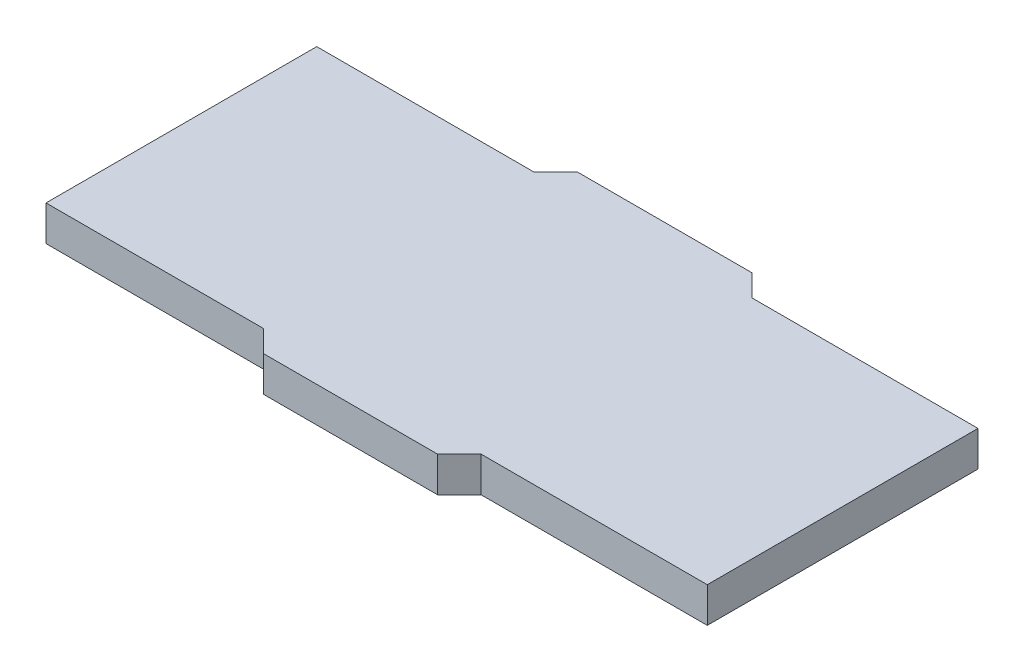
ISO-10303-21;
HEADER;
FILE_DESCRIPTION(('STEP AP214'),'2;1');
FILE_NAME('part.step','',(''),(''),'','','');
FILE_SCHEMA(('AUTOMOTIVE_DESIGN { 1 0 10303 214 1 1 1 1 }'));
ENDSEC;
DATA;
#1=APPLICATION_CONTEXT('core data for automotive mechanical design processes');
#2=APPLICATION_PROTOCOL_DEFINITION('international standard','automotive_design',2000,#1);
#3=PRODUCT_CONTEXT('',#1,'mechanical');
#4=PRODUCT('Part','Part','',(#3));
#5=PRODUCT_RELATED_PRODUCT_CATEGORY('part','',(#4));
#6=PRODUCT_DEFINITION_FORMATION('','',#4);
#7=PRODUCT_DEFINITION_CONTEXT('part definition',#1,'design');
#8=PRODUCT_DEFINITION('design','',#6,#7);
#9=PRODUCT_DEFINITION_SHAPE('','',#8);
#10=(LENGTH_UNIT() NAMED_UNIT(*) SI_UNIT(.MILLI.,.METRE.));
#11=(NAMED_UNIT(*) PLANE_ANGLE_UNIT() SI_UNIT($,.RADIAN.));
#12=(NAMED_UNIT(*) SI_UNIT($,.STERADIAN.) SOLID_ANGLE_UNIT());
#13=UNCERTAINTY_MEASURE_WITH_UNIT(LENGTH_MEASURE(1.E-05),#10,'distance_accuracy_value','');
#14=(GEOMETRIC_REPRESENTATION_CONTEXT(3) GLOBAL_UNCERTAINTY_ASSIGNED_CONTEXT((#13)) GLOBAL_UNIT_ASSIGNED_CONTEXT((#10,
#11,#12)) REPRESENTATION_CONTEXT('',''));
#15=CARTESIAN_POINT('',(0.,0.,0.));
#16=DIRECTION('',(0.,0.,1.));
#17=DIRECTION('',(1.,0.,0.));
#18=AXIS2_PLACEMENT_3D('',#15,#16,#17);
#19=CARTESIAN_POINT('',(10.,1.62,-6.223));
#20=DIRECTION('',(-0.707106781186548,0.,-0.707106781186548));
#21=DIRECTION('',(-0.707106781186548,0.,0.707106781186548));
#22=AXIS2_PLACEMENT_3D('',#19,#20,#21);
#23=PLANE('',#22);
#24=DIRECTION('',(0.707106781186548,0.,-0.707106781186548));
#25=VECTOR('',#24,1.);
#26=CARTESIAN_POINT('',(10.,0.,-6.223));
#27=LINE('',#26,#25);
#28=CARTESIAN_POINT('',(10.,0.,-6.223));
#29=VERTEX_POINT('',#28);
#30=CARTESIAN_POINT('',(11.,0.,-7.223));
#31=VERTEX_POINT('',#30);
#32=EDGE_CURVE('E154',#29,#31,#27,.T.);
#33=ORIENTED_EDGE('',*,*,#32,.F.);
#34=DIRECTION('',(0.,-1.,0.));
#35=VECTOR('',#34,1.);
#36=CARTESIAN_POINT('',(10.,1.62,-6.223));
#37=LINE('',#36,#35);
#38=CARTESIAN_POINT('',(10.,1.62,-6.223));
#39=VERTEX_POINT('',#38);
#40=EDGE_CURVE('E11',#39,#29,#37,.T.);
#41=ORIENTED_EDGE('',*,*,#40,.F.);
#42=DIRECTION('',(0.707106781186548,0.,-0.707106781186548));
#43=VECTOR('',#42,1.);
#44=CARTESIAN_POINT('',(10.,1.62,-6.223));
#45=LINE('',#44,#43);
#46=CARTESIAN_POINT('',(11.,1.62,-7.223));
#47=VERTEX_POINT('',#46);
#48=EDGE_CURVE('E179',#39,#47,#45,.T.);
#49=ORIENTED_EDGE('',*,*,#48,.T.);
#50=DIRECTION('',(0.,-1.,0.));
#51=VECTOR('',#50,1.);
#52=CARTESIAN_POINT('',(11.,1.62,-7.223));
#53=LINE('',#52,#51);
#54=EDGE_CURVE('E35',#47,#31,#53,.T.);
#55=ORIENTED_EDGE('',*,*,#54,.T.);
#56=EDGE_LOOP('',(#33,#41,#49,#55));
#57=FACE_BOUND('',#56,.T.);
#58=ADVANCED_FACE('F32',(#57),#23,.T.);
#59=CARTESIAN_POINT('',(10.,1.62,-6.223));
#60=DIRECTION('',(0.,0.,1.));
#61=DIRECTION('',(1.,0.,0.));
#62=AXIS2_PLACEMENT_3D('',#59,#60,#61);
#63=PLANE('',#62);
#64=DIRECTION('',(-1.,0.,0.));
#65=VECTOR('',#64,1.);
#66=CARTESIAN_POINT('',(10.,0.,-6.223));
#67=LINE('',#66,#65);
#68=CARTESIAN_POINT('',(0.,0.,-6.223));
#69=VERTEX_POINT('',#68);
#70=EDGE_CURVE('E89',#29,#69,#67,.T.);
#71=ORIENTED_EDGE('',*,*,#70,.T.);
#72=DIRECTION('',(0.,-1.,0.));
#73=VECTOR('',#72,1.);
#74=CARTESIAN_POINT('',(0.,1.62,-6.223));
#75=LINE('',#74,#73);
#76=CARTESIAN_POINT('',(0.,1.62,-6.223));
#77=VERTEX_POINT('',#76);
#78=EDGE_CURVE('E41',#77,#69,#75,.T.);
#79=ORIENTED_EDGE('',*,*,#78,.F.);
#80=DIRECTION('',(-1.,0.,0.));
#81=VECTOR('',#80,1.);
#82=CARTESIAN_POINT('',(10.,1.62,-6.223));
#83=LINE('',#82,#81);
#84=EDGE_CURVE('E132',#39,#77,#83,.T.);
#85=ORIENTED_EDGE('',*,*,#84,.F.);
#86=ORIENTED_EDGE('',*,*,#40,.T.);
#87=EDGE_LOOP('',(#71,#79,#85,#86));
#88=FACE_BOUND('',#87,.T.);
#89=ADVANCED_FACE('F259',(#88),#63,.F.);
#90=CARTESIAN_POINT('',(0.,1.62,-6.223));
#91=DIRECTION('',(1.,0.,0.));
#92=DIRECTION('',(0.,0.,-1.));
#93=AXIS2_PLACEMENT_3D('',#90,#91,#92);
#94=PLANE('',#93);
#95=DIRECTION('',(0.,0.,1.));
#96=VECTOR('',#95,1.);
#97=CARTESIAN_POINT('',(0.,0.,-6.223));
#98=LINE('',#97,#96);
#99=CARTESIAN_POINT('',(0.,0.,6.223));
#100=VERTEX_POINT('',#99);
#101=EDGE_CURVE('E139',#69,#100,#98,.T.);
#102=ORIENTED_EDGE('',*,*,#101,.T.);
#103=DIRECTION('',(0.,-1.,0.));
#104=VECTOR('',#103,1.);
#105=CARTESIAN_POINT('',(0.,1.62,6.223));
#106=LINE('',#105,#104);
#107=CARTESIAN_POINT('',(0.,1.62,6.223));
#108=VERTEX_POINT('',#107);
#109=EDGE_CURVE('E136',#108,#100,#106,.T.);
#110=ORIENTED_EDGE('',*,*,#109,.F.);
#111=DIRECTION('',(0.,0.,1.));
#112=VECTOR('',#111,1.);
#113=CARTESIAN_POINT('',(0.,1.62,-6.223));
#114=LINE('',#113,#112);
#115=EDGE_CURVE('E125',#77,#108,#114,.T.);
#116=ORIENTED_EDGE('',*,*,#115,.F.);
#117=ORIENTED_EDGE('',*,*,#78,.T.);
#118=EDGE_LOOP('',(#102,#110,#116,#117));
#119=FACE_BOUND('',#118,.T.);
#120=ADVANCED_FACE('F137',(#119),#94,.F.);
#121=CARTESIAN_POINT('',(0.,1.62,6.223));
#122=DIRECTION('',(0.,0.,-1.));
#123=DIRECTION('',(-1.,0.,0.));
#124=AXIS2_PLACEMENT_3D('',#121,#122,#123);
#125=PLANE('',#124);
#126=DIRECTION('',(1.,0.,0.));
#127=VECTOR('',#126,1.);
#128=CARTESIAN_POINT('',(0.,0.,6.223));
#129=LINE('',#128,#127);
#130=CARTESIAN_POINT('',(10.,0.,6.223));
#131=VERTEX_POINT('',#130);
#132=EDGE_CURVE('E176',#100,#131,#129,.T.);
#133=ORIENTED_EDGE('',*,*,#132,.T.);
#134=DIRECTION('',(0.,-1.,0.));
#135=VECTOR('',#134,1.);
#136=CARTESIAN_POINT('',(10.,1.62,6.223));
#137=LINE('',#136,#135);
#138=CARTESIAN_POINT('',(10.,1.62,6.223));
#139=VERTEX_POINT('',#138);
#140=EDGE_CURVE('E142',#139,#131,#137,.T.);
#141=ORIENTED_EDGE('',*,*,#140,.F.);
#142=DIRECTION('',(1.,0.,0.));
#143=VECTOR('',#142,1.);
#144=CARTESIAN_POINT('',(0.,1.62,6.223));
#145=LINE('',#144,#143);
#146=EDGE_CURVE('E130',#108,#139,#145,.T.);
#147=ORIENTED_EDGE('',*,*,#146,.F.);
#148=ORIENTED_EDGE('',*,*,#109,.T.);
#149=EDGE_LOOP('',(#133,#141,#147,#148));
#150=FACE_BOUND('',#149,.T.);
#151=ADVANCED_FACE('F144',(#150),#125,.F.);
#152=CARTESIAN_POINT('',(10.,1.62,6.223));
#153=DIRECTION('',(0.707106781186548,0.,-0.707106781186548));
#154=DIRECTION('',(-0.707106781186548,0.,-0.707106781186548));
#155=AXIS2_PLACEMENT_3D('',#152,#153,#154);
#156=PLANE('',#155);
#157=DIRECTION('',(0.707106781186548,0.,0.707106781186548));
#158=VECTOR('',#157,1.);
#159=CARTESIAN_POINT('',(10.,0.,6.223));
#160=LINE('',#159,#158);
#161=CARTESIAN_POINT('',(11.,0.,7.223));
#162=VERTEX_POINT('',#161);
#163=EDGE_CURVE('E174',#131,#162,#160,.T.);
#164=ORIENTED_EDGE('',*,*,#163,.T.);
#165=DIRECTION('',(0.,-1.,0.));
#166=VECTOR('',#165,1.);
#167=CARTESIAN_POINT('',(11.,1.62,7.223));
#168=LINE('',#167,#166);
#169=CARTESIAN_POINT('',(11.,1.62,7.223));
#170=VERTEX_POINT('',#169);
#171=EDGE_CURVE('E183',#170,#162,#168,.T.);
#172=ORIENTED_EDGE('',*,*,#171,.F.);
#173=DIRECTION('',(0.707106781186548,0.,0.707106781186548));
#174=VECTOR('',#173,1.);
#175=CARTESIAN_POINT('',(10.,1.62,6.223));
#176=LINE('',#175,#174);
#177=EDGE_CURVE('E147',#139,#170,#176,.T.);
#178=ORIENTED_EDGE('',*,*,#177,.F.);
#179=ORIENTED_EDGE('',*,*,#140,.T.);
#180=EDGE_LOOP('',(#164,#172,#178,#179));
#181=FACE_BOUND('',#180,.T.);
#182=ADVANCED_FACE('F207',(#181),#156,.F.);
#183=CARTESIAN_POINT('',(11.,1.62,7.223));
#184=DIRECTION('',(0.,0.,-1.));
#185=DIRECTION('',(-1.,0.,0.));
#186=AXIS2_PLACEMENT_3D('',#183,#184,#185);
#187=PLANE('',#186);
#188=DIRECTION('',(1.,0.,0.));
#189=VECTOR('',#188,1.);
#190=CARTESIAN_POINT('',(11.,0.,7.223));
#191=LINE('',#190,#189);
#192=CARTESIAN_POINT('',(19.,0.,7.223));
#193=VERTEX_POINT('',#192);
#194=EDGE_CURVE('E172',#162,#193,#191,.T.);
#195=ORIENTED_EDGE('',*,*,#194,.T.);
#196=DIRECTION('',(0.,-1.,0.));
#197=VECTOR('',#196,1.);
#198=CARTESIAN_POINT('',(19.,1.62,7.223));
#199=LINE('',#198,#197);
#200=CARTESIAN_POINT('',(19.,1.62,7.223));
#201=VERTEX_POINT('',#200);
#202=EDGE_CURVE('E186',#201,#193,#199,.T.);
#203=ORIENTED_EDGE('',*,*,#202,.F.);
#204=DIRECTION('',(1.,0.,0.));
#205=VECTOR('',#204,1.);
#206=CARTESIAN_POINT('',(11.,1.62,7.223));
#207=LINE('',#206,#205);
#208=EDGE_CURVE('E149',#170,#201,#207,.T.);
#209=ORIENTED_EDGE('',*,*,#208,.F.);
#210=ORIENTED_EDGE('',*,*,#171,.T.);
#211=EDGE_LOOP('',(#195,#203,#209,#210));
#212=FACE_BOUND('',#211,.T.);
#213=ADVANCED_FACE('F215',(#212),#187,.F.);
#214=CARTESIAN_POINT('',(19.,1.62,7.223));
#215=DIRECTION('',(-0.707106781186548,0.,-0.707106781186547));
#216=DIRECTION('',(-0.707106781186547,0.,0.707106781186548));
#217=AXIS2_PLACEMENT_3D('',#214,#215,#216);
#218=PLANE('',#217);
#219=DIRECTION('',(0.707106781186547,0.,-0.707106781186548));
#220=VECTOR('',#219,1.);
#221=CARTESIAN_POINT('',(19.,0.,7.223));
#222=LINE('',#221,#220);
#223=CARTESIAN_POINT('',(20.,0.,6.223));
#224=VERTEX_POINT('',#223);
#225=EDGE_CURVE('E170',#193,#224,#222,.T.);
#226=ORIENTED_EDGE('',*,*,#225,.T.);
#227=DIRECTION('',(0.,-1.,0.));
#228=VECTOR('',#227,1.);
#229=CARTESIAN_POINT('',(20.,1.62,6.223));
#230=LINE('',#229,#228);
#231=CARTESIAN_POINT('',(20.,1.62,6.223));
#232=VERTEX_POINT('',#231);
#233=EDGE_CURVE('E189',#232,#224,#230,.T.);
#234=ORIENTED_EDGE('',*,*,#233,.F.);
#235=DIRECTION('',(0.707106781186547,0.,-0.707106781186548));
#236=VECTOR('',#235,1.);
#237=CARTESIAN_POINT('',(19.,1.62,7.223));
#238=LINE('',#237,#236);
#239=EDGE_CURVE('E212',#201,#232,#238,.T.);
#240=ORIENTED_EDGE('',*,*,#239,.F.);
#241=ORIENTED_EDGE('',*,*,#202,.T.);
#242=EDGE_LOOP('',(#226,#234,#240,#241));
#243=FACE_BOUND('',#242,.T.);
#244=ADVANCED_FACE('F218',(#243),#218,.F.);
#245=CARTESIAN_POINT('',(20.,1.62,6.223));
#246=DIRECTION('',(0.,0.,-1.));
#247=DIRECTION('',(-1.,0.,0.));
#248=AXIS2_PLACEMENT_3D('',#245,#246,#247);
#249=PLANE('',#248);
#250=DIRECTION('',(1.,0.,0.));
#251=VECTOR('',#250,1.);
#252=CARTESIAN_POINT('',(20.,0.,6.223));
#253=LINE('',#252,#251);
#254=CARTESIAN_POINT('',(30.4,0.,6.223));
#255=VERTEX_POINT('',#254);
#256=EDGE_CURVE('E168',#224,#255,#253,.T.);
#257=ORIENTED_EDGE('',*,*,#256,.T.);
#258=DIRECTION('',(0.,-1.,0.));
#259=VECTOR('',#258,1.);
#260=CARTESIAN_POINT('',(30.4,1.62,6.223));
#261=LINE('',#260,#259);
#262=CARTESIAN_POINT('',(30.4,1.62,6.223));
#263=VERTEX_POINT('',#262);
#264=EDGE_CURVE('E192',#263,#255,#261,.T.);
#265=ORIENTED_EDGE('',*,*,#264,.F.);
#266=DIRECTION('',(1.,0.,0.));
#267=VECTOR('',#266,1.);
#268=CARTESIAN_POINT('',(20.,1.62,6.223));
#269=LINE('',#268,#267);
#270=EDGE_CURVE('E220',#232,#263,#269,.T.);
#271=ORIENTED_EDGE('',*,*,#270,.F.);
#272=ORIENTED_EDGE('',*,*,#233,.T.);
#273=EDGE_LOOP('',(#257,#265,#271,#272));
#274=FACE_BOUND('',#273,.T.);
#275=ADVANCED_FACE('F249',(#274),#249,.F.);
#276=CARTESIAN_POINT('',(30.4,1.62,6.223));
#277=DIRECTION('',(-1.,0.,0.));
#278=DIRECTION('',(0.,0.,1.));
#279=AXIS2_PLACEMENT_3D('',#276,#277,#278);
#280=PLANE('',#279);
#281=DIRECTION('',(0.,0.,-1.));
#282=VECTOR('',#281,1.);
#283=CARTESIAN_POINT('',(30.4,0.,6.223));
#284=LINE('',#283,#282);
#285=CARTESIAN_POINT('',(30.4,0.,-6.223));
#286=VERTEX_POINT('',#285);
#287=EDGE_CURVE('E166',#255,#286,#284,.T.);
#288=ORIENTED_EDGE('',*,*,#287,.T.);
#289=DIRECTION('',(0.,-1.,0.));
#290=VECTOR('',#289,1.);
#291=CARTESIAN_POINT('',(30.4,1.62,-6.223));
#292=LINE('',#291,#290);
#293=CARTESIAN_POINT('',(30.4,1.62,-6.223));
#294=VERTEX_POINT('',#293);
#295=EDGE_CURVE('E195',#294,#286,#292,.T.);
#296=ORIENTED_EDGE('',*,*,#295,.F.);
#297=DIRECTION('',(0.,0.,-1.));
#298=VECTOR('',#297,1.);
#299=CARTESIAN_POINT('',(30.4,1.62,6.223));
#300=LINE('',#299,#298);
#301=EDGE_CURVE('E222',#263,#294,#300,.T.);
#302=ORIENTED_EDGE('',*,*,#301,.F.);
#303=ORIENTED_EDGE('',*,*,#264,.T.);
#304=EDGE_LOOP('',(#288,#296,#302,#303));
#305=FACE_BOUND('',#304,.T.);
#306=ADVANCED_FACE('F246',(#305),#280,.F.);
#307=CARTESIAN_POINT('',(30.4,1.62,-6.223));
#308=DIRECTION('',(0.,0.,1.));
#309=DIRECTION('',(1.,0.,0.));
#310=AXIS2_PLACEMENT_3D('',#307,#308,#309);
#311=PLANE('',#310);
#312=DIRECTION('',(-1.,0.,0.));
#313=VECTOR('',#312,1.);
#314=CARTESIAN_POINT('',(30.4,0.,-6.223));
#315=LINE('',#314,#313);
#316=CARTESIAN_POINT('',(20.,0.,-6.223));
#317=VERTEX_POINT('',#316);
#318=EDGE_CURVE('E163',#286,#317,#315,.T.);
#319=ORIENTED_EDGE('',*,*,#318,.T.);
#320=DIRECTION('',(0.,-1.,0.));
#321=VECTOR('',#320,1.);
#322=CARTESIAN_POINT('',(20.,1.62,-6.223));
#323=LINE('',#322,#321);
#324=CARTESIAN_POINT('',(20.,1.62,-6.223));
#325=VERTEX_POINT('',#324);
#326=EDGE_CURVE('E198',#325,#317,#323,.T.);
#327=ORIENTED_EDGE('',*,*,#326,.F.);
#328=DIRECTION('',(-1.,0.,0.));
#329=VECTOR('',#328,1.);
#330=CARTESIAN_POINT('',(30.4,1.62,-6.223));
#331=LINE('',#330,#329);
#332=EDGE_CURVE('E226',#294,#325,#331,.T.);
#333=ORIENTED_EDGE('',*,*,#332,.F.);
#334=ORIENTED_EDGE('',*,*,#295,.T.);
#335=EDGE_LOOP('',(#319,#327,#333,#334));
#336=FACE_BOUND('',#335,.T.);
#337=ADVANCED_FACE('F242',(#336),#311,.F.);
#338=CARTESIAN_POINT('',(19.,1.62,-7.223));
#339=DIRECTION('',(0.707106781186547,0.,-0.707106781186548));
#340=DIRECTION('',(-0.707106781186548,0.,-0.707106781186547));
#341=AXIS2_PLACEMENT_3D('',#338,#339,#340);
#342=PLANE('',#341);
#343=DIRECTION('',(0.707106781186548,0.,0.707106781186547));
#344=VECTOR('',#343,1.);
#345=CARTESIAN_POINT('',(19.,0.,-7.223));
#346=LINE('',#345,#344);
#347=CARTESIAN_POINT('',(19.,0.,-7.223));
#348=VERTEX_POINT('',#347);
#349=EDGE_CURVE('E160',#348,#317,#346,.T.);
#350=ORIENTED_EDGE('',*,*,#349,.F.);
#351=DIRECTION('',(0.,-1.,0.));
#352=VECTOR('',#351,1.);
#353=CARTESIAN_POINT('',(19.,1.62,-7.223));
#354=LINE('',#353,#352);
#355=CARTESIAN_POINT('',(19.,1.62,-7.223));
#356=VERTEX_POINT('',#355);
#357=EDGE_CURVE('E199',#356,#348,#354,.T.);
#358=ORIENTED_EDGE('',*,*,#357,.F.);
#359=DIRECTION('',(0.707106781186548,0.,0.707106781186547));
#360=VECTOR('',#359,1.);
#361=CARTESIAN_POINT('',(19.,1.62,-7.223));
#362=LINE('',#361,#360);
#363=EDGE_CURVE('E228',#356,#325,#362,.T.);
#364=ORIENTED_EDGE('',*,*,#363,.T.);
#365=ORIENTED_EDGE('',*,*,#326,.T.);
#366=EDGE_LOOP('',(#350,#358,#364,#365));
#367=FACE_BOUND('',#366,.T.);
#368=ADVANCED_FACE('F237',(#367),#342,.T.);
#369=CARTESIAN_POINT('',(11.,1.62,-7.223));
#370=DIRECTION('',(0.,0.,-1.));
#371=DIRECTION('',(-1.,0.,0.));
#372=AXIS2_PLACEMENT_3D('',#369,#370,#371);
#373=PLANE('',#372);
#374=DIRECTION('',(1.,0.,0.));
#375=VECTOR('',#374,1.);
#376=CARTESIAN_POINT('',(11.,0.,-7.223));
#377=LINE('',#376,#375);
#378=EDGE_CURVE('E157',#31,#348,#377,.T.);
#379=ORIENTED_EDGE('',*,*,#378,.F.);
#380=ORIENTED_EDGE('',*,*,#54,.F.);
#381=DIRECTION('',(1.,0.,0.));
#382=VECTOR('',#381,1.);
#383=CARTESIAN_POINT('',(11.,1.62,-7.223));
#384=LINE('',#383,#382);
#385=EDGE_CURVE('E231',#47,#356,#384,.T.);
#386=ORIENTED_EDGE('',*,*,#385,.T.);
#387=ORIENTED_EDGE('',*,*,#357,.T.);
#388=EDGE_LOOP('',(#379,#380,#386,#387));
#389=FACE_BOUND('',#388,.T.);
#390=ADVANCED_FACE('F201',(#389),#373,.T.);
#391=CARTESIAN_POINT('',(0.,1.62,0.));
#392=DIRECTION('',(0.,-1.,0.));
#393=DIRECTION('',(0.,0.,-1.));
#394=AXIS2_PLACEMENT_3D('',#391,#392,#393);
#395=PLANE('',#394);
#396=ORIENTED_EDGE('',*,*,#48,.F.);
#397=ORIENTED_EDGE('',*,*,#84,.T.);
#398=ORIENTED_EDGE('',*,*,#115,.T.);
#399=ORIENTED_EDGE('',*,*,#146,.T.);
#400=ORIENTED_EDGE('',*,*,#177,.T.);
#401=ORIENTED_EDGE('',*,*,#208,.T.);
#402=ORIENTED_EDGE('',*,*,#239,.T.);
#403=ORIENTED_EDGE('',*,*,#270,.T.);
#404=ORIENTED_EDGE('',*,*,#301,.T.);
#405=ORIENTED_EDGE('',*,*,#332,.T.);
#406=ORIENTED_EDGE('',*,*,#363,.F.);
#407=ORIENTED_EDGE('',*,*,#385,.F.);
#408=EDGE_LOOP('',(#396,#397,#398,#399,#400,#401,#402,#403,#404,#405,#406,#407));
#409=FACE_BOUND('',#408,.T.);
#410=ADVANCED_FACE('F128',(#409),#395,.F.);
#411=CARTESIAN_POINT('',(0.,0.,0.));
#412=DIRECTION('',(0.,-1.,0.));
#413=DIRECTION('',(0.,0.,-1.));
#414=AXIS2_PLACEMENT_3D('',#411,#412,#413);
#415=PLANE('',#414);
#416=ORIENTED_EDGE('',*,*,#32,.T.);
#417=ORIENTED_EDGE('',*,*,#378,.T.);
#418=ORIENTED_EDGE('',*,*,#349,.T.);
#419=ORIENTED_EDGE('',*,*,#318,.F.);
#420=ORIENTED_EDGE('',*,*,#287,.F.);
#421=ORIENTED_EDGE('',*,*,#256,.F.);
#422=ORIENTED_EDGE('',*,*,#225,.F.);
#423=ORIENTED_EDGE('',*,*,#194,.F.);
#424=ORIENTED_EDGE('',*,*,#163,.F.);
#425=ORIENTED_EDGE('',*,*,#132,.F.);
#426=ORIENTED_EDGE('',*,*,#101,.F.);
#427=ORIENTED_EDGE('',*,*,#70,.F.);
#428=EDGE_LOOP('',(#416,#417,#418,#419,#420,#421,#422,#423,#424,#425,#426,#427));
#429=FACE_BOUND('',#428,.T.);
#430=ADVANCED_FACE('F203',(#429),#415,.T.);
#431=CLOSED_SHELL('',(#58,#89,#120,#151,#182,#213,#244,#275,#306,#337,#368,#390,#410,#430));
#432=MANIFOLD_SOLID_BREP('B2',#431);
#433=ADVANCED_BREP_SHAPE_REPRESENTATION('',(#18,#432),#14);
#434=SHAPE_DEFINITION_REPRESENTATION(#9,#433);
ENDSEC;
END-ISO-10303-21;
